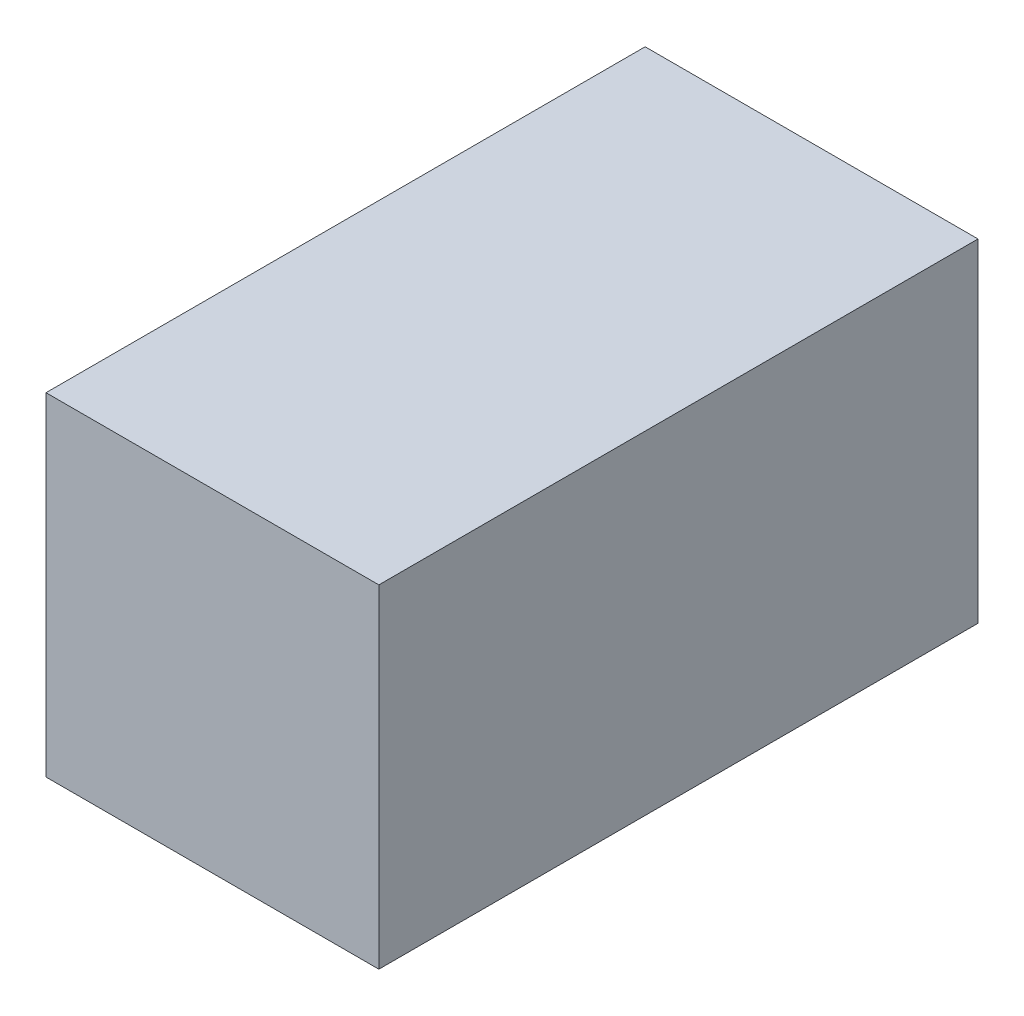
ISO-10303-21;
HEADER;
FILE_DESCRIPTION(('STEP AP214'),'2;1');
FILE_NAME('part.step','',(''),(''),'','','');
FILE_SCHEMA(('AUTOMOTIVE_DESIGN { 1 0 10303 214 1 1 1 1 }'));
ENDSEC;
DATA;
#1=APPLICATION_CONTEXT('core data for automotive mechanical design processes');
#2=APPLICATION_PROTOCOL_DEFINITION('international standard','automotive_design',2000,#1);
#3=PRODUCT_CONTEXT('',#1,'mechanical');
#4=PRODUCT('Part','Part','',(#3));
#5=PRODUCT_RELATED_PRODUCT_CATEGORY('part','',(#4));
#6=PRODUCT_DEFINITION_FORMATION('','',#4);
#7=PRODUCT_DEFINITION_CONTEXT('part definition',#1,'design');
#8=PRODUCT_DEFINITION('design','',#6,#7);
#9=PRODUCT_DEFINITION_SHAPE('','',#8);
#10=(LENGTH_UNIT() NAMED_UNIT(*) SI_UNIT(.MILLI.,.METRE.));
#11=(NAMED_UNIT(*) PLANE_ANGLE_UNIT() SI_UNIT($,.RADIAN.));
#12=(NAMED_UNIT(*) SI_UNIT($,.STERADIAN.) SOLID_ANGLE_UNIT());
#13=UNCERTAINTY_MEASURE_WITH_UNIT(LENGTH_MEASURE(1.E-05),#10,'distance_accuracy_value','');
#14=(GEOMETRIC_REPRESENTATION_CONTEXT(3) GLOBAL_UNCERTAINTY_ASSIGNED_CONTEXT((#13)) GLOBAL_UNIT_ASSIGNED_CONTEXT((#10,
#11,#12)) REPRESENTATION_CONTEXT('',''));
#15=CARTESIAN_POINT('',(0.,0.,0.));
#16=DIRECTION('',(0.,0.,1.));
#17=DIRECTION('',(1.,0.,0.));
#18=AXIS2_PLACEMENT_3D('',#15,#16,#17);
#19=CARTESIAN_POINT('',(-30.324074074074,22.337962962963,90.));
#20=DIRECTION('',(1.,0.,0.));
#21=DIRECTION('',(0.,0.,-1.));
#22=AXIS2_PLACEMENT_3D('',#19,#20,#21);
#23=PLANE('',#22);
#24=DIRECTION('',(0.,-1.,0.));
#25=VECTOR('',#24,1.);
#26=CARTESIAN_POINT('',(-30.324074074074,22.337962962963,0.));
#27=LINE('',#26,#25);
#28=CARTESIAN_POINT('',(-30.324074074074,22.337962962963,0.));
#29=VERTEX_POINT('',#28);
#30=CARTESIAN_POINT('',(-30.324074074074,-27.6620370370371,0.));
#31=VERTEX_POINT('',#30);
#32=EDGE_CURVE('E79',#29,#31,#27,.T.);
#33=ORIENTED_EDGE('',*,*,#32,.T.);
#34=DIRECTION('',(0.,0.,-1.));
#35=VECTOR('',#34,1.);
#36=CARTESIAN_POINT('',(-30.324074074074,-27.6620370370371,90.));
#37=LINE('',#36,#35);
#38=CARTESIAN_POINT('',(-30.324074074074,-27.6620370370371,90.));
#39=VERTEX_POINT('',#38);
#40=EDGE_CURVE('E11',#39,#31,#37,.T.);
#41=ORIENTED_EDGE('',*,*,#40,.F.);
#42=DIRECTION('',(0.,-1.,0.));
#43=VECTOR('',#42,1.);
#44=CARTESIAN_POINT('',(-30.324074074074,22.337962962963,90.));
#45=LINE('',#44,#43);
#46=CARTESIAN_POINT('',(-30.324074074074,22.337962962963,90.));
#47=VERTEX_POINT('',#46);
#48=EDGE_CURVE('E67',#47,#39,#45,.T.);
#49=ORIENTED_EDGE('',*,*,#48,.F.);
#50=DIRECTION('',(0.,0.,-1.));
#51=VECTOR('',#50,1.);
#52=CARTESIAN_POINT('',(-30.324074074074,22.337962962963,90.));
#53=LINE('',#52,#51);
#54=EDGE_CURVE('E75',#47,#29,#53,.T.);
#55=ORIENTED_EDGE('',*,*,#54,.T.);
#56=EDGE_LOOP('',(#33,#41,#49,#55));
#57=FACE_BOUND('',#56,.T.);
#58=ADVANCED_FACE('F16',(#57),#23,.F.);
#59=CARTESIAN_POINT('',(-30.324074074074,-27.6620370370371,90.));
#60=DIRECTION('',(0.,1.,0.));
#61=DIRECTION('',(0.,0.,1.));
#62=AXIS2_PLACEMENT_3D('',#59,#60,#61);
#63=PLANE('',#62);
#64=DIRECTION('',(1.,0.,0.));
#65=VECTOR('',#64,1.);
#66=CARTESIAN_POINT('',(-30.324074074074,-27.6620370370371,0.));
#67=LINE('',#66,#65);
#68=CARTESIAN_POINT('',(19.675925925926,-27.6620370370371,0.));
#69=VERTEX_POINT('',#68);
#70=EDGE_CURVE('E71',#31,#69,#67,.T.);
#71=ORIENTED_EDGE('',*,*,#70,.T.);
#72=DIRECTION('',(0.,0.,-1.));
#73=VECTOR('',#72,1.);
#74=CARTESIAN_POINT('',(19.675925925926,-27.6620370370371,90.));
#75=LINE('',#74,#73);
#76=CARTESIAN_POINT('',(19.675925925926,-27.6620370370371,90.));
#77=VERTEX_POINT('',#76);
#78=EDGE_CURVE('E24',#77,#69,#75,.T.);
#79=ORIENTED_EDGE('',*,*,#78,.F.);
#80=DIRECTION('',(1.,0.,0.));
#81=VECTOR('',#80,1.);
#82=CARTESIAN_POINT('',(-30.324074074074,-27.6620370370371,90.));
#83=LINE('',#82,#81);
#84=EDGE_CURVE('E62',#39,#77,#83,.T.);
#85=ORIENTED_EDGE('',*,*,#84,.F.);
#86=ORIENTED_EDGE('',*,*,#40,.T.);
#87=EDGE_LOOP('',(#71,#79,#85,#86));
#88=FACE_BOUND('',#87,.T.);
#89=ADVANCED_FACE('F70',(#88),#63,.F.);
#90=CARTESIAN_POINT('',(19.675925925926,22.337962962963,90.));
#91=DIRECTION('',(-1.,0.,0.));
#92=DIRECTION('',(0.,-1.,0.));
#93=AXIS2_PLACEMENT_3D('',#90,#91,#92);
#94=PLANE('',#93);
#95=DIRECTION('',(0.,1.,0.));
#96=VECTOR('',#95,1.);
#97=CARTESIAN_POINT('',(19.675925925926,22.337962962963,0.));
#98=LINE('',#97,#96);
#99=CARTESIAN_POINT('',(19.675925925926,22.337962962963,0.));
#100=VERTEX_POINT('',#99);
#101=EDGE_CURVE('E49',#69,#100,#98,.T.);
#102=ORIENTED_EDGE('',*,*,#101,.T.);
#103=DIRECTION('',(0.,0.,-1.));
#104=VECTOR('',#103,1.);
#105=CARTESIAN_POINT('',(19.675925925926,22.337962962963,90.));
#106=LINE('',#105,#104);
#107=CARTESIAN_POINT('',(19.675925925926,22.337962962963,90.));
#108=VERTEX_POINT('',#107);
#109=EDGE_CURVE('E72',#108,#100,#106,.T.);
#110=ORIENTED_EDGE('',*,*,#109,.F.);
#111=DIRECTION('',(0.,1.,0.));
#112=VECTOR('',#111,1.);
#113=CARTESIAN_POINT('',(19.675925925926,22.337962962963,90.));
#114=LINE('',#113,#112);
#115=EDGE_CURVE('E65',#77,#108,#114,.T.);
#116=ORIENTED_EDGE('',*,*,#115,.F.);
#117=ORIENTED_EDGE('',*,*,#78,.T.);
#118=EDGE_LOOP('',(#102,#110,#116,#117));
#119=FACE_BOUND('',#118,.T.);
#120=ADVANCED_FACE('F73',(#119),#94,.F.);
#121=CARTESIAN_POINT('',(-30.324074074074,22.337962962963,90.));
#122=DIRECTION('',(0.,-1.,0.));
#123=DIRECTION('',(0.,0.,-1.));
#124=AXIS2_PLACEMENT_3D('',#121,#122,#123);
#125=PLANE('',#124);
#126=DIRECTION('',(-1.,0.,0.));
#127=VECTOR('',#126,1.);
#128=CARTESIAN_POINT('',(-30.324074074074,22.337962962963,0.));
#129=LINE('',#128,#127);
#130=EDGE_CURVE('E55',#100,#29,#129,.T.);
#131=ORIENTED_EDGE('',*,*,#130,.T.);
#132=ORIENTED_EDGE('',*,*,#54,.F.);
#133=DIRECTION('',(-1.,0.,0.));
#134=VECTOR('',#133,1.);
#135=CARTESIAN_POINT('',(-30.324074074074,22.337962962963,90.));
#136=LINE('',#135,#134);
#137=EDGE_CURVE('E32',#108,#47,#136,.T.);
#138=ORIENTED_EDGE('',*,*,#137,.F.);
#139=ORIENTED_EDGE('',*,*,#109,.T.);
#140=EDGE_LOOP('',(#131,#132,#138,#139));
#141=FACE_BOUND('',#140,.T.);
#142=ADVANCED_FACE('F86',(#141),#125,.F.);
#143=CARTESIAN_POINT('',(0.,0.,90.));
#144=DIRECTION('',(0.,0.,1.));
#145=DIRECTION('',(1.,0.,0.));
#146=AXIS2_PLACEMENT_3D('',#143,#144,#145);
#147=PLANE('',#146);
#148=ORIENTED_EDGE('',*,*,#48,.T.);
#149=ORIENTED_EDGE('',*,*,#84,.T.);
#150=ORIENTED_EDGE('',*,*,#115,.T.);
#151=ORIENTED_EDGE('',*,*,#137,.T.);
#152=EDGE_LOOP('',(#148,#149,#150,#151));
#153=FACE_BOUND('',#152,.T.);
#154=ADVANCED_FACE('F63',(#153),#147,.T.);
#155=CARTESIAN_POINT('',(0.,0.,0.));
#156=DIRECTION('',(0.,0.,1.));
#157=DIRECTION('',(1.,0.,0.));
#158=AXIS2_PLACEMENT_3D('',#155,#156,#157);
#159=PLANE('',#158);
#160=ORIENTED_EDGE('',*,*,#32,.F.);
#161=ORIENTED_EDGE('',*,*,#130,.F.);
#162=ORIENTED_EDGE('',*,*,#101,.F.);
#163=ORIENTED_EDGE('',*,*,#70,.F.);
#164=EDGE_LOOP('',(#160,#161,#162,#163));
#165=FACE_BOUND('',#164,.T.);
#166=ADVANCED_FACE('F89',(#165),#159,.F.);
#167=CLOSED_SHELL('',(#58,#89,#120,#142,#154,#166));
#168=MANIFOLD_SOLID_BREP('B1',#167);
#169=ADVANCED_BREP_SHAPE_REPRESENTATION('',(#18,#168),#14);
#170=SHAPE_DEFINITION_REPRESENTATION(#9,#169);
ENDSEC;
END-ISO-10303-21;
